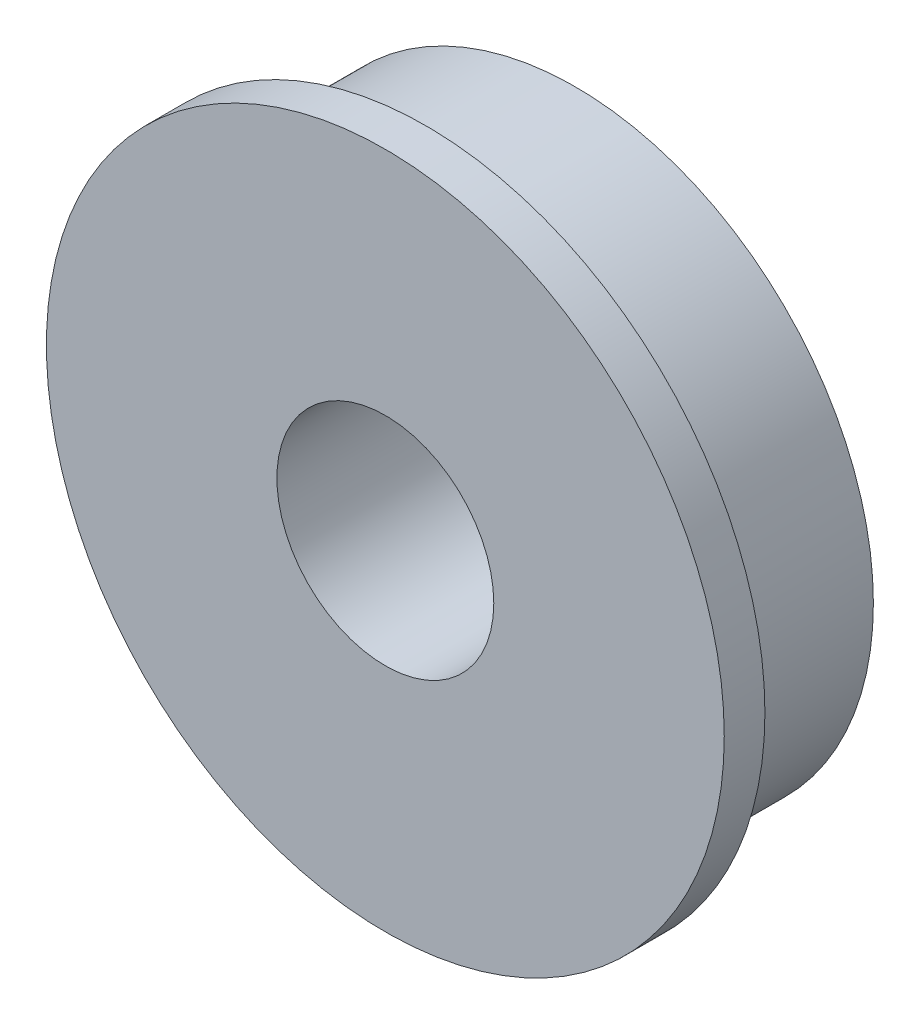
ISO-10303-21;
HEADER;
FILE_DESCRIPTION(('STEP AP214'),'2;1');
FILE_NAME('part.step','',(''),(''),'','','');
FILE_SCHEMA(('AUTOMOTIVE_DESIGN { 1 0 10303 214 1 1 1 1 }'));
ENDSEC;
DATA;
#1=APPLICATION_CONTEXT('core data for automotive mechanical design processes');
#2=APPLICATION_PROTOCOL_DEFINITION('international standard','automotive_design',2000,#1);
#3=PRODUCT_CONTEXT('',#1,'mechanical');
#4=PRODUCT('Part','Part','',(#3));
#5=PRODUCT_RELATED_PRODUCT_CATEGORY('part','',(#4));
#6=PRODUCT_DEFINITION_FORMATION('','',#4);
#7=PRODUCT_DEFINITION_CONTEXT('part definition',#1,'design');
#8=PRODUCT_DEFINITION('design','',#6,#7);
#9=PRODUCT_DEFINITION_SHAPE('','',#8);
#10=(LENGTH_UNIT() NAMED_UNIT(*) SI_UNIT(.MILLI.,.METRE.));
#11=(NAMED_UNIT(*) PLANE_ANGLE_UNIT() SI_UNIT($,.RADIAN.));
#12=(NAMED_UNIT(*) SI_UNIT($,.STERADIAN.) SOLID_ANGLE_UNIT());
#13=UNCERTAINTY_MEASURE_WITH_UNIT(LENGTH_MEASURE(1.E-05),#10,'distance_accuracy_value','');
#14=(GEOMETRIC_REPRESENTATION_CONTEXT(3) GLOBAL_UNCERTAINTY_ASSIGNED_CONTEXT((#13)) GLOBAL_UNIT_ASSIGNED_CONTEXT((#10,
#11,#12)) REPRESENTATION_CONTEXT('',''));
#15=CARTESIAN_POINT('',(0.,0.,0.));
#16=DIRECTION('',(0.,0.,1.));
#17=DIRECTION('',(1.,0.,0.));
#18=AXIS2_PLACEMENT_3D('',#15,#16,#17);
#19=CARTESIAN_POINT('',(0.,0.,0.));
#20=DIRECTION('',(0.,0.,1.));
#21=DIRECTION('',(1.,0.,0.));
#22=AXIS2_PLACEMENT_3D('',#19,#20,#21);
#23=PLANE('',#22);
#24=CARTESIAN_POINT('',(0.,0.,0.));
#25=DIRECTION('',(0.,0.,1.));
#26=DIRECTION('',(1.,0.,0.));
#27=AXIS2_PLACEMENT_3D('',#24,#25,#26);
#28=CIRCLE('',#27,11.);
#29=CARTESIAN_POINT('',(11.,0.,0.));
#30=VERTEX_POINT('',#29);
#31=EDGE_CURVE('E35',#30,#30,#28,.T.);
#32=ORIENTED_EDGE('',*,*,#31,.F.);
#33=EDGE_LOOP('',(#32));
#34=FACE_BOUND('',#33,.T.);
#35=CARTESIAN_POINT('',(0.,0.,0.));
#36=DIRECTION('',(0.,0.,1.));
#37=DIRECTION('',(1.,0.,0.));
#38=AXIS2_PLACEMENT_3D('',#35,#36,#37);
#39=CIRCLE('',#38,4.);
#40=CARTESIAN_POINT('',(4.,0.,0.));
#41=VERTEX_POINT('',#40);
#42=EDGE_CURVE('E42',#41,#41,#39,.T.);
#43=ORIENTED_EDGE('',*,*,#42,.T.);
#44=EDGE_LOOP('',(#43));
#45=FACE_BOUND('',#44,.T.);
#46=ADVANCED_FACE('F31',(#34,#45),#23,.F.);
#47=CARTESIAN_POINT('',(0.,0.,5.5));
#48=DIRECTION('',(0.,0.,-1.));
#49=DIRECTION('',(-1.,0.,0.));
#50=AXIS2_PLACEMENT_3D('',#47,#48,#49);
#51=CYLINDRICAL_SURFACE('',#50,11.);
#52=CARTESIAN_POINT('',(0.,0.,5.5));
#53=DIRECTION('',(0.,0.,1.));
#54=DIRECTION('',(1.,0.,0.));
#55=AXIS2_PLACEMENT_3D('',#52,#53,#54);
#56=CIRCLE('',#55,11.);
#57=CARTESIAN_POINT('',(11.,0.,5.5));
#58=VERTEX_POINT('',#57);
#59=EDGE_CURVE('E10',#58,#58,#56,.T.);
#60=ORIENTED_EDGE('',*,*,#59,.F.);
#61=EDGE_LOOP('',(#60));
#62=FACE_BOUND('',#61,.T.);
#63=ORIENTED_EDGE('',*,*,#31,.T.);
#64=EDGE_LOOP('',(#63));
#65=FACE_BOUND('',#64,.T.);
#66=ADVANCED_FACE('F33',(#62,#65),#51,.T.);
#67=CARTESIAN_POINT('',(0.,0.,5.5));
#68=DIRECTION('',(0.,0.,-1.));
#69=DIRECTION('',(-1.,0.,0.));
#70=AXIS2_PLACEMENT_3D('',#67,#68,#69);
#71=CYLINDRICAL_SURFACE('',#70,4.);
#72=ORIENTED_EDGE('',*,*,#42,.F.);
#73=EDGE_LOOP('',(#72));
#74=FACE_BOUND('',#73,.T.);
#75=CARTESIAN_POINT('',(0.,0.,7.));
#76=DIRECTION('',(0.,0.,1.));
#77=DIRECTION('',(1.,0.,0.));
#78=AXIS2_PLACEMENT_3D('',#75,#76,#77);
#79=CIRCLE('',#78,4.);
#80=CARTESIAN_POINT('',(4.,0.,7.));
#81=VERTEX_POINT('',#80);
#82=EDGE_CURVE('E50',#81,#81,#79,.T.);
#83=ORIENTED_EDGE('',*,*,#82,.T.);
#84=EDGE_LOOP('',(#83));
#85=FACE_BOUND('',#84,.T.);
#86=ADVANCED_FACE('F56',(#74,#85),#71,.F.);
#87=CARTESIAN_POINT('',(0.,0.,5.5));
#88=DIRECTION('',(0.,0.,1.));
#89=DIRECTION('',(1.,0.,0.));
#90=AXIS2_PLACEMENT_3D('',#87,#88,#89);
#91=PLANE('',#90);
#92=CARTESIAN_POINT('',(0.,0.,5.5));
#93=DIRECTION('',(0.,0.,1.));
#94=DIRECTION('',(1.,0.,0.));
#95=AXIS2_PLACEMENT_3D('',#92,#93,#94);
#96=CIRCLE('',#95,12.5);
#97=CARTESIAN_POINT('',(12.5,0.,5.5));
#98=VERTEX_POINT('',#97);
#99=EDGE_CURVE('E47',#98,#98,#96,.T.);
#100=ORIENTED_EDGE('',*,*,#99,.F.);
#101=EDGE_LOOP('',(#100));
#102=FACE_BOUND('',#101,.T.);
#103=ORIENTED_EDGE('',*,*,#59,.T.);
#104=EDGE_LOOP('',(#103));
#105=FACE_BOUND('',#104,.T.);
#106=ADVANCED_FACE('F61',(#102,#105),#91,.F.);
#107=CARTESIAN_POINT('',(0.,0.,7.));
#108=DIRECTION('',(0.,0.,1.));
#109=DIRECTION('',(1.,0.,0.));
#110=AXIS2_PLACEMENT_3D('',#107,#108,#109);
#111=PLANE('',#110);
#112=CARTESIAN_POINT('',(0.,0.,7.));
#113=DIRECTION('',(0.,0.,1.));
#114=DIRECTION('',(1.,0.,0.));
#115=AXIS2_PLACEMENT_3D('',#112,#113,#114);
#116=CIRCLE('',#115,12.5);
#117=CARTESIAN_POINT('',(12.5,0.,7.));
#118=VERTEX_POINT('',#117);
#119=EDGE_CURVE('E46',#118,#118,#116,.T.);
#120=ORIENTED_EDGE('',*,*,#119,.T.);
#121=EDGE_LOOP('',(#120));
#122=FACE_BOUND('',#121,.T.);
#123=ORIENTED_EDGE('',*,*,#82,.F.);
#124=EDGE_LOOP('',(#123));
#125=FACE_BOUND('',#124,.T.);
#126=ADVANCED_FACE('F58',(#122,#125),#111,.T.);
#127=CARTESIAN_POINT('',(0.,0.,7.));
#128=DIRECTION('',(0.,0.,-1.));
#129=DIRECTION('',(-1.,0.,0.));
#130=AXIS2_PLACEMENT_3D('',#127,#128,#129);
#131=CYLINDRICAL_SURFACE('',#130,12.5);
#132=ORIENTED_EDGE('',*,*,#119,.F.);
#133=EDGE_LOOP('',(#132));
#134=FACE_BOUND('',#133,.T.);
#135=ORIENTED_EDGE('',*,*,#99,.T.);
#136=EDGE_LOOP('',(#135));
#137=FACE_BOUND('',#136,.T.);
#138=ADVANCED_FACE('F60',(#134,#137),#131,.T.);
#139=CLOSED_SHELL('',(#46,#66,#86,#106,#126,#138));
#140=MANIFOLD_SOLID_BREP('B2',#139);
#141=ADVANCED_BREP_SHAPE_REPRESENTATION('',(#18,#140),#14);
#142=SHAPE_DEFINITION_REPRESENTATION(#9,#141);
ENDSEC;
END-ISO-10303-21;
